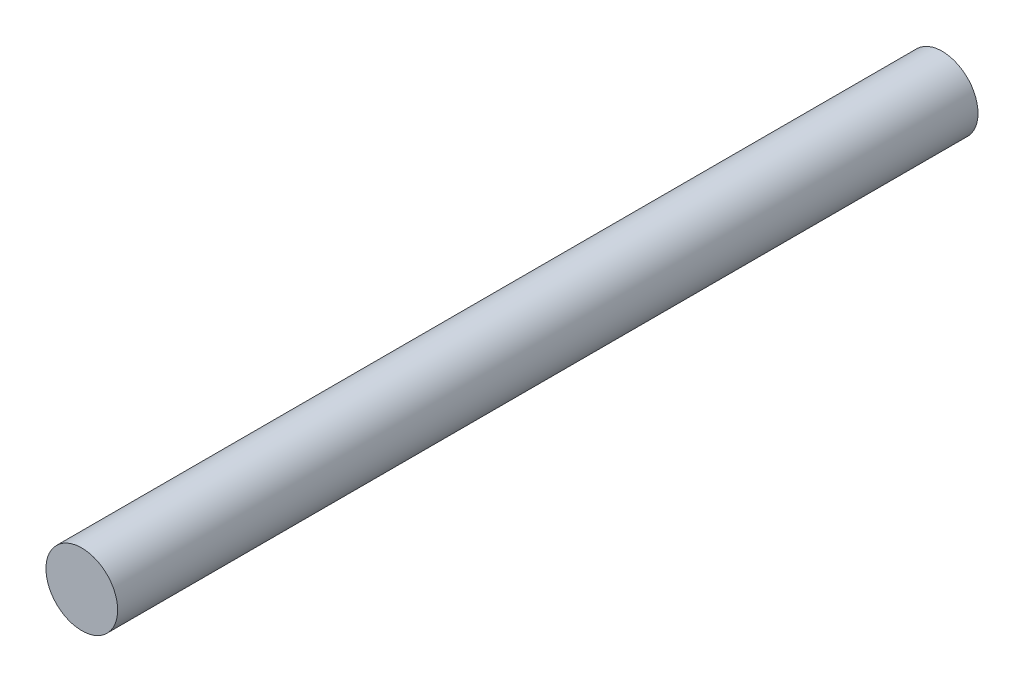
ISO-10303-21;
HEADER;
FILE_DESCRIPTION(('STEP AP214'),'2;1');
FILE_NAME('part.step','',(''),(''),'','','');
FILE_SCHEMA(('AUTOMOTIVE_DESIGN { 1 0 10303 214 1 1 1 1 }'));
ENDSEC;
DATA;
#1=APPLICATION_CONTEXT('core data for automotive mechanical design processes');
#2=APPLICATION_PROTOCOL_DEFINITION('international standard','automotive_design',2000,#1);
#3=PRODUCT_CONTEXT('',#1,'mechanical');
#4=PRODUCT('Part','Part','',(#3));
#5=PRODUCT_RELATED_PRODUCT_CATEGORY('part','',(#4));
#6=PRODUCT_DEFINITION_FORMATION('','',#4);
#7=PRODUCT_DEFINITION_CONTEXT('part definition',#1,'design');
#8=PRODUCT_DEFINITION('design','',#6,#7);
#9=PRODUCT_DEFINITION_SHAPE('','',#8);
#10=(LENGTH_UNIT() NAMED_UNIT(*) SI_UNIT(.MILLI.,.METRE.));
#11=(NAMED_UNIT(*) PLANE_ANGLE_UNIT() SI_UNIT($,.RADIAN.));
#12=(NAMED_UNIT(*) SI_UNIT($,.STERADIAN.) SOLID_ANGLE_UNIT());
#13=UNCERTAINTY_MEASURE_WITH_UNIT(LENGTH_MEASURE(1.E-05),#10,'distance_accuracy_value','');
#14=(GEOMETRIC_REPRESENTATION_CONTEXT(3) GLOBAL_UNCERTAINTY_ASSIGNED_CONTEXT((#13)) GLOBAL_UNIT_ASSIGNED_CONTEXT((#10,
#11,#12)) REPRESENTATION_CONTEXT('',''));
#15=CARTESIAN_POINT('',(0.,0.,0.));
#16=DIRECTION('',(0.,0.,1.));
#17=DIRECTION('',(1.,0.,0.));
#18=AXIS2_PLACEMENT_3D('',#15,#16,#17);
#19=CARTESIAN_POINT('',(0.,0.,120.));
#20=DIRECTION('',(0.,0.,-1.));
#21=DIRECTION('',(-1.,0.,0.));
#22=AXIS2_PLACEMENT_3D('',#19,#20,#21);
#23=CYLINDRICAL_SURFACE('',#22,5.);
#24=CARTESIAN_POINT('',(0.,0.,120.));
#25=DIRECTION('',(0.,0.,1.));
#26=DIRECTION('',(1.,0.,0.));
#27=AXIS2_PLACEMENT_3D('',#24,#25,#26);
#28=CIRCLE('',#27,5.);
#29=CARTESIAN_POINT('',(5.,0.,120.));
#30=VERTEX_POINT('',#29);
#31=EDGE_CURVE('E10',#30,#30,#28,.T.);
#32=ORIENTED_EDGE('',*,*,#31,.F.);
#33=EDGE_LOOP('',(#32));
#34=FACE_BOUND('',#33,.T.);
#35=CARTESIAN_POINT('',(0.,0.,0.));
#36=DIRECTION('',(0.,0.,1.));
#37=DIRECTION('',(1.,0.,0.));
#38=AXIS2_PLACEMENT_3D('',#35,#36,#37);
#39=CIRCLE('',#38,5.);
#40=CARTESIAN_POINT('',(5.,0.,0.));
#41=VERTEX_POINT('',#40);
#42=EDGE_CURVE('E34',#41,#41,#39,.T.);
#43=ORIENTED_EDGE('',*,*,#42,.T.);
#44=EDGE_LOOP('',(#43));
#45=FACE_BOUND('',#44,.T.);
#46=ADVANCED_FACE('F31',(#34,#45),#23,.T.);
#47=CARTESIAN_POINT('',(0.,0.,120.));
#48=DIRECTION('',(0.,0.,1.));
#49=DIRECTION('',(1.,0.,0.));
#50=AXIS2_PLACEMENT_3D('',#47,#48,#49);
#51=PLANE('',#50);
#52=ORIENTED_EDGE('',*,*,#31,.T.);
#53=EDGE_LOOP('',(#52));
#54=FACE_BOUND('',#53,.T.);
#55=ADVANCED_FACE('F46',(#54),#51,.T.);
#56=CARTESIAN_POINT('',(0.,0.,0.));
#57=DIRECTION('',(0.,0.,1.));
#58=DIRECTION('',(1.,0.,0.));
#59=AXIS2_PLACEMENT_3D('',#56,#57,#58);
#60=PLANE('',#59);
#61=ORIENTED_EDGE('',*,*,#42,.F.);
#62=EDGE_LOOP('',(#61));
#63=FACE_BOUND('',#62,.T.);
#64=ADVANCED_FACE('F44',(#63),#60,.F.);
#65=CLOSED_SHELL('',(#46,#55,#64));
#66=MANIFOLD_SOLID_BREP('B2',#65);
#67=ADVANCED_BREP_SHAPE_REPRESENTATION('',(#18,#66),#14);
#68=SHAPE_DEFINITION_REPRESENTATION(#9,#67);
ENDSEC;
END-ISO-10303-21;
